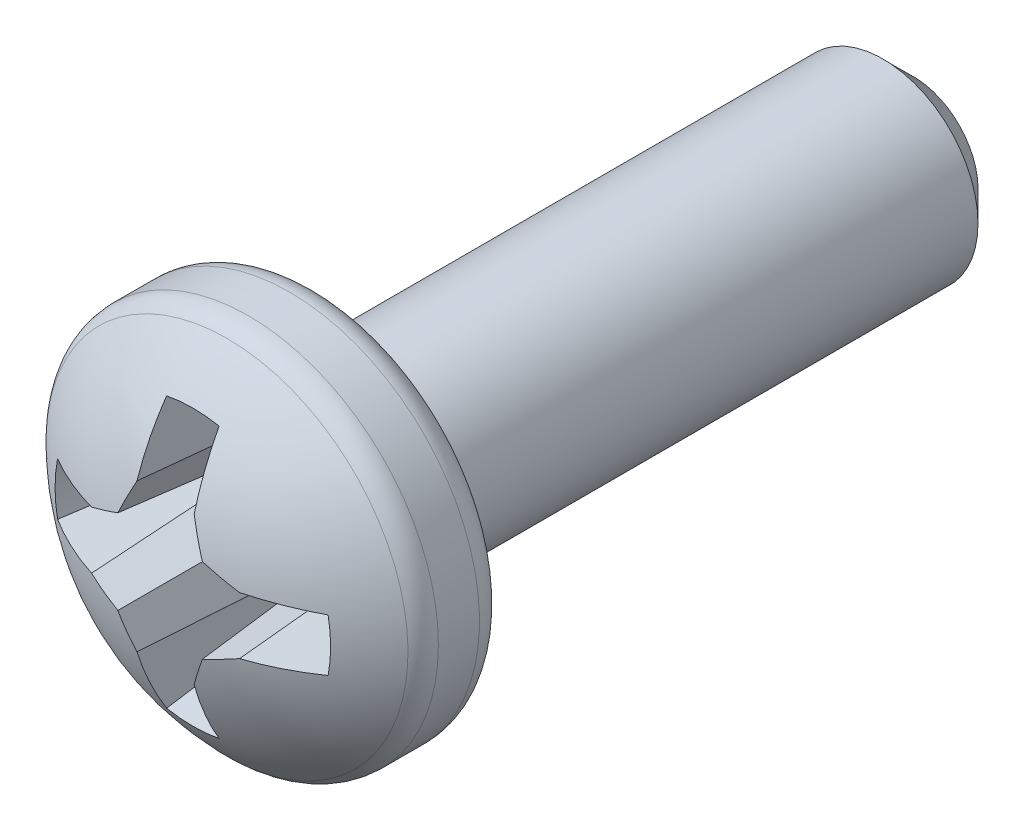
ISO-10303-21;
HEADER;
FILE_DESCRIPTION(('STEP AP214'),'2;1');
FILE_NAME('part.step','',(''),(''),'','','');
FILE_SCHEMA(('AUTOMOTIVE_DESIGN { 1 0 10303 214 1 1 1 1 }'));
ENDSEC;
DATA;
#1=APPLICATION_CONTEXT('core data for automotive mechanical design processes');
#2=APPLICATION_PROTOCOL_DEFINITION('international standard','automotive_design',2000,#1);
#3=PRODUCT_CONTEXT('',#1,'mechanical');
#4=PRODUCT('Part','Part','',(#3));
#5=PRODUCT_RELATED_PRODUCT_CATEGORY('part','',(#4));
#6=PRODUCT_DEFINITION_FORMATION('','',#4);
#7=PRODUCT_DEFINITION_CONTEXT('part definition',#1,'design');
#8=PRODUCT_DEFINITION('design','',#6,#7);
#9=PRODUCT_DEFINITION_SHAPE('','',#8);
#10=(LENGTH_UNIT() NAMED_UNIT(*) SI_UNIT(.MILLI.,.METRE.));
#11=(NAMED_UNIT(*) PLANE_ANGLE_UNIT() SI_UNIT($,.RADIAN.));
#12=(NAMED_UNIT(*) SI_UNIT($,.STERADIAN.) SOLID_ANGLE_UNIT());
#13=UNCERTAINTY_MEASURE_WITH_UNIT(LENGTH_MEASURE(1.E-05),#10,'distance_accuracy_value','');
#14=(GEOMETRIC_REPRESENTATION_CONTEXT(3) GLOBAL_UNCERTAINTY_ASSIGNED_CONTEXT((#13)) GLOBAL_UNIT_ASSIGNED_CONTEXT((#10,
#11,#12)) REPRESENTATION_CONTEXT('',''));
#15=CARTESIAN_POINT('',(0.,0.,0.));
#16=DIRECTION('',(0.,0.,1.));
#17=DIRECTION('',(1.,0.,0.));
#18=AXIS2_PLACEMENT_3D('',#15,#16,#17);
#19=CARTESIAN_POINT('',(-0.181321674615797,0.791461441644268,0.413196607862429));
#20=DIRECTION('',(0.,0.,1.));
#21=DIRECTION('',(1.,0.,0.));
#22=AXIS2_PLACEMENT_3D('',#19,#20,#21);
#23=PLANE('',#22);
#24=DIRECTION('',(0.382683432365081,-0.92387953251129,0.));
#25=VECTOR('',#24,1.);
#26=CARTESIAN_POINT('',(-0.168007787845929,0.796976234112247,0.413196607862429));
#27=LINE('',#26,#25);
#28=CARTESIAN_POINT('',(-0.175578033261302,0.815252423264536,0.413196607862429));
#29=VERTEX_POINT('',#28);
#30=CARTESIAN_POINT('',(-0.170292089679838,0.802491026580226,0.413196607862429));
#31=VERTEX_POINT('',#30);
#32=EDGE_CURVE('E292',#29,#31,#27,.T.);
#33=ORIENTED_EDGE('',*,*,#32,.F.);
#34=DIRECTION('',(0.,1.,0.));
#35=VECTOR('',#34,1.);
#36=CARTESIAN_POINT('',(-0.175578033261302,0.791461441644268,0.413196607862429));
#37=LINE('',#36,#35);
#38=CARTESIAN_POINT('',(-0.175578033261302,0.827667770296582,0.413196607862429));
#39=VERTEX_POINT('',#38);
#40=EDGE_CURVE('E168',#39,#29,#37,.F.);
#41=ORIENTED_EDGE('',*,*,#40,.F.);
#42=CARTESIAN_POINT('',(-0.181321674615797,0.791461441644268,0.413196607862429));
#43=DIRECTION('',(0.,0.,1.));
#44=DIRECTION('',(1.,0.,0.));
#45=AXIS2_PLACEMENT_3D('',#42,#43,#44);
#46=CIRCLE('',#45,0.0366590732355365);
#47=CARTESIAN_POINT('',(-0.187065315970288,0.827667770296583,0.413196607862429));
#48=VERTEX_POINT('',#47);
#49=EDGE_CURVE('E159',#39,#48,#46,.T.);
#50=ORIENTED_EDGE('',*,*,#49,.T.);
#51=DIRECTION('',(0.,1.,0.));
#52=VECTOR('',#51,1.);
#53=CARTESIAN_POINT('',(-0.187065315970287,0.791461441644271,0.413196607862429));
#54=LINE('',#53,#52);
#55=CARTESIAN_POINT('',(-0.187065315970288,0.815252423264539,0.413196607862429));
#56=VERTEX_POINT('',#55);
#57=EDGE_CURVE('E166',#56,#48,#54,.T.);
#58=ORIENTED_EDGE('',*,*,#57,.F.);
#59=DIRECTION('',(0.382683432365079,0.923879532511291,0.));
#60=VECTOR('',#59,1.);
#61=CARTESIAN_POINT('',(-0.194635561385662,0.79697623411225,0.413196607862429));
#62=LINE('',#61,#60);
#63=CARTESIAN_POINT('',(-0.192351259551752,0.802491026580229,0.413196607862429));
#64=VERTEX_POINT('',#63);
#65=EDGE_CURVE('E301',#64,#56,#62,.T.);
#66=ORIENTED_EDGE('',*,*,#65,.F.);
#67=DIRECTION('',(0.923879532511289,0.382683432365086,0.));
#68=VECTOR('',#67,1.);
#69=CARTESIAN_POINT('',(-0.186836467083772,0.804775328414139,0.413196607862429));
#70=LINE('',#69,#68);
#71=CARTESIAN_POINT('',(-0.205112656236062,0.797205082998765,0.413196607862429));
#72=VERTEX_POINT('',#71);
#73=EDGE_CURVE('E307',#72,#64,#70,.T.);
#74=ORIENTED_EDGE('',*,*,#73,.F.);
#75=DIRECTION('',(1.,0.,0.));
#76=VECTOR('',#75,1.);
#77=CARTESIAN_POINT('',(-0.181321674615793,0.797205082998765,0.413196607862429));
#78=LINE('',#77,#76);
#79=CARTESIAN_POINT('',(-0.217528003323473,0.797205082997996,0.413196607853642));
#80=VERTEX_POINT('',#79);
#81=EDGE_CURVE('E313',#80,#72,#78,.T.);
#82=ORIENTED_EDGE('',*,*,#81,.F.);
#83=CARTESIAN_POINT('',(-0.181321674615794,0.791461441644271,0.413196607862429));
#84=DIRECTION('',(0.,0.,1.));
#85=DIRECTION('',(1.,0.,0.));
#86=AXIS2_PLACEMENT_3D('',#83,#84,#85);
#87=CIRCLE('',#86,0.0366590732924525);
#88=CARTESIAN_POINT('',(-0.217528003325736,0.78571780028978,0.413196607862429));
#89=VERTEX_POINT('',#88);
#90=EDGE_CURVE('E410',#80,#89,#87,.T.);
#91=ORIENTED_EDGE('',*,*,#90,.T.);
#92=DIRECTION('',(1.,0.,0.));
#93=VECTOR('',#92,1.);
#94=CARTESIAN_POINT('',(-0.181321674615797,0.78571780028978,0.413196607862429));
#95=LINE('',#94,#93);
#96=CARTESIAN_POINT('',(-0.205112656236065,0.78571780028978,0.413196607862429));
#97=VERTEX_POINT('',#96);
#98=EDGE_CURVE('E247',#97,#89,#95,.F.);
#99=ORIENTED_EDGE('',*,*,#98,.F.);
#100=DIRECTION('',(-0.923879532511292,0.382683432365076,0.));
#101=VECTOR('',#100,1.);
#102=CARTESIAN_POINT('',(-0.186836467083776,0.778147554874406,0.413196607862429));
#103=LINE('',#102,#101);
#104=CARTESIAN_POINT('',(-0.192351259551755,0.780431856708316,0.413196607862429));
#105=VERTEX_POINT('',#104);
#106=EDGE_CURVE('E248',#105,#97,#103,.T.);
#107=ORIENTED_EDGE('',*,*,#106,.F.);
#108=DIRECTION('',(-0.38268343236509,0.923879532511287,0.));
#109=VECTOR('',#108,1.);
#110=CARTESIAN_POINT('',(-0.194635561385665,0.785946649176296,0.413196607862429));
#111=LINE('',#110,#109);
#112=CARTESIAN_POINT('',(-0.18706531597029,0.767670460024005,0.413196607862429));
#113=VERTEX_POINT('',#112);
#114=EDGE_CURVE('E254',#113,#105,#111,.T.);
#115=ORIENTED_EDGE('',*,*,#114,.F.);
#116=DIRECTION('',(0.,1.,0.));
#117=VECTOR('',#116,1.);
#118=CARTESIAN_POINT('',(-0.187065315970291,0.791461441644275,0.413196607862429));
#119=LINE('',#118,#117);
#120=CARTESIAN_POINT('',(-0.18706531597029,0.755255112961119,0.413196607862429));
#121=VERTEX_POINT('',#120);
#122=EDGE_CURVE('E260',#121,#113,#119,.T.);
#123=ORIENTED_EDGE('',*,*,#122,.F.);
#124=CARTESIAN_POINT('',(-0.181321674615796,0.791461441644275,0.413196607862429));
#125=DIRECTION('',(0.,0.,1.));
#126=DIRECTION('',(1.,0.,0.));
#127=AXIS2_PLACEMENT_3D('',#124,#125,#126);
#128=CIRCLE('',#127,0.0366590732659973);
#129=CARTESIAN_POINT('',(-0.175578033261305,0.755255112961118,0.413196607862429));
#130=VERTEX_POINT('',#129);
#131=EDGE_CURVE('E336',#121,#130,#128,.T.);
#132=ORIENTED_EDGE('',*,*,#131,.T.);
#133=DIRECTION('',(0.,1.,0.));
#134=VECTOR('',#133,1.);
#135=CARTESIAN_POINT('',(-0.175578033261306,0.791461441644272,0.413196607862429));
#136=LINE('',#135,#134);
#137=CARTESIAN_POINT('',(-0.175578033261305,0.767670460024002,0.413196607862429));
#138=VERTEX_POINT('',#137);
#139=EDGE_CURVE('E266',#138,#130,#136,.F.);
#140=ORIENTED_EDGE('',*,*,#139,.F.);
#141=DIRECTION('',(-0.382683432365075,-0.923879532511293,0.));
#142=VECTOR('',#141,1.);
#143=CARTESIAN_POINT('',(-0.168007787845931,0.785946649176293,0.413196607862429));
#144=LINE('',#143,#142);
#145=CARTESIAN_POINT('',(-0.170292089679841,0.780431856708313,0.413196607862429));
#146=VERTEX_POINT('',#145);
#147=EDGE_CURVE('E267',#146,#138,#144,.T.);
#148=ORIENTED_EDGE('',*,*,#147,.F.);
#149=DIRECTION('',(-0.923879532511286,-0.382683432365092,0.));
#150=VECTOR('',#149,1.);
#151=CARTESIAN_POINT('',(-0.175806882147821,0.778147554874402,0.413196607862429));
#152=LINE('',#151,#150);
#153=CARTESIAN_POINT('',(-0.157530692995531,0.785717800289777,0.413196607862429));
#154=VERTEX_POINT('',#153);
#155=EDGE_CURVE('E273',#154,#146,#152,.T.);
#156=ORIENTED_EDGE('',*,*,#155,.F.);
#157=DIRECTION('',(1.,0.,0.));
#158=VECTOR('',#157,1.);
#159=CARTESIAN_POINT('',(-0.1813216746158,0.785717800289777,0.413196607862429));
#160=LINE('',#159,#158);
#161=CARTESIAN_POINT('',(-0.145115345963483,0.785717800289777,0.413196607862429));
#162=VERTEX_POINT('',#161);
#163=EDGE_CURVE('E279',#162,#154,#160,.F.);
#164=ORIENTED_EDGE('',*,*,#163,.F.);
#165=CARTESIAN_POINT('',(-0.181321674615797,0.791461441644268,0.413196607862429));
#166=DIRECTION('',(0.,0.,1.));
#167=DIRECTION('',(1.,0.,0.));
#168=AXIS2_PLACEMENT_3D('',#165,#166,#167);
#169=CIRCLE('',#168,0.0366590732355365);
#170=CARTESIAN_POINT('',(-0.145115345963483,0.797205082998762,0.413196607862429));
#171=VERTEX_POINT('',#170);
#172=EDGE_CURVE('E492',#162,#171,#169,.T.);
#173=ORIENTED_EDGE('',*,*,#172,.T.);
#174=DIRECTION('',(1.,0.,0.));
#175=VECTOR('',#174,1.);
#176=CARTESIAN_POINT('',(-0.181321674615797,0.797205082998762,0.413196607862429));
#177=LINE('',#176,#175);
#178=CARTESIAN_POINT('',(-0.157530692995528,0.797205082998762,0.413196607862429));
#179=VERTEX_POINT('',#178);
#180=EDGE_CURVE('E285',#179,#171,#177,.T.);
#181=ORIENTED_EDGE('',*,*,#180,.F.);
#182=DIRECTION('',(0.92387953251129,-0.382683432365083,0.));
#183=VECTOR('',#182,1.);
#184=CARTESIAN_POINT('',(-0.175806882147818,0.804775328414136,0.413196607862429));
#185=LINE('',#184,#183);
#186=EDGE_CURVE('E286',#31,#179,#185,.T.);
#187=ORIENTED_EDGE('',*,*,#186,.F.);
#188=EDGE_LOOP('',(#33,#41,#50,#58,#66,#74,#82,#91,#99,#107,#115,#123,#132,#140,#148,#156,#164,
#173,#181,#187));
#189=FACE_BOUND('',#188,.T.);
#190=ADVANCED_FACE('F17',(#189),#23,.T.);
#191=CARTESIAN_POINT('',(-0.181321674615793,0.801303961329311,0.460047001563216));
#192=DIRECTION('',(0.,-0.996194698091744,0.0871557427476727));
#193=DIRECTION('',(0.,-0.0871557427476727,-0.996194698091744));
#194=AXIS2_PLACEMENT_3D('',#191,#192,#193);
#195=PLANE('',#194);
#196=DIRECTION('',(0.0173337504938655,-0.0871426484044457,-0.996045029063885));
#197=VECTOR('',#196,1.);
#198=CARTESIAN_POINT('',(-0.205856056740422,0.8009424097128,0.455914447676356));
#199=LINE('',#198,#197);
#200=CARTESIAN_POINT('',(-0.205856056740422,0.8009424097128,0.455914447676356));
#201=VERTEX_POINT('',#200);
#202=EDGE_CURVE('E310',#201,#72,#199,.T.);
#203=ORIENTED_EDGE('',*,*,#202,.F.);
#204=CARTESIAN_POINT('',(-0.2261693076876,0.80015108887588,0.446869609122098));
#205=CARTESIAN_POINT('',(-0.222980948004435,0.800321424804083,0.448816557690383));
#206=CARTESIAN_POINT('',(-0.219693997250593,0.800472536171256,0.450543768520713));
#207=CARTESIAN_POINT('',(-0.212922913601555,0.800736309783543,0.453558714705461));
#208=CARTESIAN_POINT('',(-0.209438780706359,0.800848972028658,0.45484645005988));
#209=CARTESIAN_POINT('',(-0.205856056740486,0.800942409712743,0.455914447676343));
#210=B_SPLINE_CURVE_WITH_KNOTS('',3,(#204,#205,#206,#207,#208,#209),.UNSPECIFIED.,.F.,.F.,(4,2,
4),(0.,0.0111485978671279,0.0222971957342558),.UNSPECIFIED.);
#211=CARTESIAN_POINT('',(-0.226169307677023,0.800151088874494,0.446869609106245));
#212=VERTEX_POINT('',#211);
#213=EDGE_CURVE('E409',#212,#201,#210,.T.);
#214=ORIENTED_EDGE('',*,*,#213,.F.);
#215=CARTESIAN_POINT('',(-0.226169307666445,0.800151088873107,0.446869609090391));
#216=CARTESIAN_POINT('',(-0.224732839888683,0.79966000435443,0.441256487356838));
#217=CARTESIAN_POINT('',(-0.223294497313129,0.799168961608414,0.435643843086986));
#218=CARTESIAN_POINT('',(-0.220414062531476,0.798186959649785,0.424419509338453));
#219=CARTESIAN_POINT('',(-0.218971970325285,0.797696000437175,0.418807819859794));
#220=CARTESIAN_POINT('',(-0.217528003321212,0.797205082997228,0.413196607844861));
#221=B_SPLINE_CURVE_WITH_KNOTS('',3,(#215,#216,#217,#218,#219,#220),.UNSPECIFIED.,.F.,.F.,(4,2,
4),(0.,0.0174443558891328,0.0348887122017161),.UNSPECIFIED.);
#222=EDGE_CURVE('E318',#212,#80,#221,.T.);
#223=ORIENTED_EDGE('',*,*,#222,.T.);
#224=ORIENTED_EDGE('',*,*,#81,.T.);
#225=EDGE_LOOP('',(#203,#214,#223,#224));
#226=FACE_BOUND('',#225,.T.);
#227=ADVANCED_FACE('F427',(#226),#195,.T.);
#228=CARTESIAN_POINT('',(-0.188405039912152,0.808562198209984,0.460047001563216));
#229=DIRECTION('',(0.381227206369649,-0.920363891963225,0.0871557427476661));
#230=DIRECTION('',(0.923879532511289,0.382683432365086,0.));
#231=AXIS2_PLACEMENT_3D('',#228,#229,#230);
#232=PLANE('',#231);
#233=DIRECTION('',(0.066662691346821,-0.0666626913468416,-0.995546167269401));
#234=VECTOR('',#233,1.);
#235=CARTESIAN_POINT('',(-0.195333038303313,0.805472805331791,0.457726739301586));
#236=LINE('',#235,#234);
#237=CARTESIAN_POINT('',(-0.195333038303313,0.805472805331791,0.457726739301586));
#238=VERTEX_POINT('',#237);
#239=EDGE_CURVE('E304',#238,#64,#236,.T.);
#240=ORIENTED_EDGE('',*,*,#239,.F.);
#241=CARTESIAN_POINT('',(-0.205856056740422,0.8009424097128,0.455914447676356));
#242=CARTESIAN_POINT('',(-0.204125687185487,0.801700049456702,0.456346321822599));
#243=CARTESIAN_POINT('',(-0.202383584204927,0.802456402296903,0.456713283197823));
#244=CARTESIAN_POINT('',(-0.198875911392557,0.8039665341699,0.457317380406233));
#245=CARTESIAN_POINT('',(-0.197110341560748,0.804720313202696,0.457554516239419));
#246=CARTESIAN_POINT('',(-0.195333038303313,0.805472805331791,0.457726739301586));
#247=B_SPLINE_CURVE_WITH_KNOTS('',3,(#241,#242,#243,#244,#245,#246),.UNSPECIFIED.,.F.,.F.,(4,2,
4),(0.,0.00580300590917773,0.0116060118183554),.UNSPECIFIED.);
#248=EDGE_CURVE('E439',#201,#238,#247,.T.);
#249=ORIENTED_EDGE('',*,*,#248,.F.);
#250=ORIENTED_EDGE('',*,*,#202,.T.);
#251=ORIENTED_EDGE('',*,*,#73,.T.);
#252=EDGE_LOOP('',(#240,#249,#250,#251));
#253=FACE_BOUND('',#252,.T.);
#254=ADVANCED_FACE('F431',(#253),#232,.T.);
#255=CARTESIAN_POINT('',(-0.198422431181506,0.79854480694063,0.460047001563216));
#256=DIRECTION('',(0.920363891963229,-0.381227206369643,0.0871557427476506));
#257=DIRECTION('',(0.382683432365079,0.923879532511291,0.));
#258=AXIS2_PLACEMENT_3D('',#255,#256,#257);
#259=PLANE('',#258);
#260=DIRECTION('',(0.0871426484044251,-0.0173337504938855,-0.996045029063886));
#261=VECTOR('',#260,1.);
#262=CARTESIAN_POINT('',(-0.190802642684322,0.8159958237689,0.455914447676355));
#263=LINE('',#262,#261);
#264=CARTESIAN_POINT('',(-0.190802642684322,0.8159958237689,0.455914447676355));
#265=VERTEX_POINT('',#264);
#266=EDGE_CURVE('E176',#265,#56,#263,.T.);
#267=ORIENTED_EDGE('',*,*,#266,.F.);
#268=CARTESIAN_POINT('',(-0.195333038303313,0.805472805331791,0.457726739301586));
#269=CARTESIAN_POINT('',(-0.194580546174218,0.807250108589226,0.457554516239419));
#270=CARTESIAN_POINT('',(-0.193826767141422,0.809015678421036,0.457317380406232));
#271=CARTESIAN_POINT('',(-0.192316635268425,0.812523351233405,0.456713283197822));
#272=CARTESIAN_POINT('',(-0.191560282428224,0.814265454213965,0.456346321822598));
#273=CARTESIAN_POINT('',(-0.190802642684322,0.8159958237689,0.455914447676355));
#274=B_SPLINE_CURVE_WITH_KNOTS('',3,(#268,#269,#270,#271,#272,#273),.UNSPECIFIED.,.F.,.F.,(4,2,
4),(0.,0.00580300590917794,0.0116060118183557),.UNSPECIFIED.);
#275=EDGE_CURVE('E445',#238,#265,#274,.T.);
#276=ORIENTED_EDGE('',*,*,#275,.F.);
#277=ORIENTED_EDGE('',*,*,#239,.T.);
#278=ORIENTED_EDGE('',*,*,#65,.T.);
#279=EDGE_LOOP('',(#267,#276,#277,#278));
#280=FACE_BOUND('',#279,.T.);
#281=ADVANCED_FACE('F436',(#280),#259,.T.);
#282=CARTESIAN_POINT('',(-0.191164194300832,0.791461441644271,0.460047001563216));
#283=DIRECTION('',(0.996194698091747,0.,0.0871557427476441));
#284=DIRECTION('',(0.0871557427476441,0.,-0.996194698091747));
#285=AXIS2_PLACEMENT_3D('',#282,#283,#284);
#286=PLANE('',#285);
#287=CARTESIAN_POINT('',(-0.187065315976045,0.827667770305358,0.413196607882864));
#288=CARTESIAN_POINT('',(-0.187556233413911,0.829111737314682,0.418807819896698));
#289=CARTESIAN_POINT('',(-0.188047192625085,0.830553829526685,0.424419509374058));
#290=CARTESIAN_POINT('',(-0.189029194582127,0.833434264321087,0.435643843119598));
#291=CARTESIAN_POINT('',(-0.189520237327995,0.834872606903579,0.441256487387755));
#292=CARTESIAN_POINT('',(-0.190011321847168,0.83630907468884,0.446869609119416));
#293=B_SPLINE_CURVE_WITH_KNOTS('',3,(#287,#288,#289,#290,#291,#292),.UNSPECIFIED.,.F.,.F.,(4,2,
4),(0.,0.0174443563127849,0.0348887122021206),.UNSPECIFIED.);
#294=CARTESIAN_POINT('',(-0.19001132184661,0.836309074687208,0.446869609113043));
#295=VERTEX_POINT('',#294);
#296=EDGE_CURVE('E170',#48,#295,#293,.T.);
#297=ORIENTED_EDGE('',*,*,#296,.T.);
#298=CARTESIAN_POINT('',(-0.190802642684322,0.8159958237689,0.455914447676355));
#299=CARTESIAN_POINT('',(-0.190709205000274,0.819578547732283,0.454846450060644));
#300=CARTESIAN_POINT('',(-0.190596542755232,0.823062680625144,0.45355871470727));
#301=CARTESIAN_POINT('',(-0.190332769143161,0.829833764269824,0.450543768525194));
#302=CARTESIAN_POINT('',(-0.190181657776132,0.833120715021642,0.448816557696492));
#303=CARTESIAN_POINT('',(-0.19001132184811,0.836309074702938,0.446869609130127));
#304=B_SPLINE_CURVE_WITH_KNOTS('',3,(#298,#299,#300,#301,#302,#303),.UNSPECIFIED.,.F.,.F.,(4,2,
4),(0.,0.0111485978594692,0.0222971957189382),.UNSPECIFIED.);
#305=EDGE_CURVE('E450',#265,#295,#304,.T.);
#306=ORIENTED_EDGE('',*,*,#305,.F.);
#307=ORIENTED_EDGE('',*,*,#266,.T.);
#308=ORIENTED_EDGE('',*,*,#57,.T.);
#309=EDGE_LOOP('',(#297,#306,#307,#308));
#310=FACE_BOUND('',#309,.T.);
#311=ADVANCED_FACE('F173',(#310),#286,.T.);
#312=CARTESIAN_POINT('',(-0.181321674615797,0.791461441644268,0.44686960910667));
#313=DIRECTION('',(0.,0.,1.));
#314=DIRECTION('',(0.,-1.,0.));
#315=AXIS2_PLACEMENT_3D('',#312,#313,#314);
#316=CONICAL_SURFACE('',#315,0.0456817267448834,0.261799388331704);
#317=ORIENTED_EDGE('',*,*,#296,.F.);
#318=ORIENTED_EDGE('',*,*,#49,.F.);
#319=CARTESIAN_POINT('',(-0.172632027379857,0.836309074694092,0.446869609126833));
#320=CARTESIAN_POINT('',(-0.17312311190055,0.834872606907088,0.441256487392621));
#321=CARTESIAN_POINT('',(-0.173614154647945,0.833434264322827,0.435643843121919));
#322=CARTESIAN_POINT('',(-0.17459615660806,0.830553829524832,0.424419509371304));
#323=CARTESIAN_POINT('',(-0.175087115820778,0.829111737311007,0.418807819891415));
#324=CARTESIAN_POINT('',(-0.175578033260197,0.827667770299833,0.41319660787506));
#325=B_SPLINE_CURVE_WITH_KNOTS('',3,(#319,#320,#321,#322,#323,#324),.UNSPECIFIED.,.F.,.F.,(4,2,
4),(0.,0.0174443558984041,0.0348887122202595),.UNSPECIFIED.);
#326=CARTESIAN_POINT('',(-0.172632027383567,0.836309074696746,0.446869609129184));
#327=VERTEX_POINT('',#326);
#328=EDGE_CURVE('E182',#327,#39,#325,.T.);
#329=ORIENTED_EDGE('',*,*,#328,.F.);
#330=CARTESIAN_POINT('',(-0.181321674615797,0.791461441644268,0.44686960910667));
#331=DIRECTION('',(0.,0.,1.));
#332=DIRECTION('',(0.,-1.,0.));
#333=AXIS2_PLACEMENT_3D('',#330,#331,#332);
#334=CIRCLE('',#333,0.0456817267448834);
#335=EDGE_CURVE('E180',#295,#327,#334,.F.);
#336=ORIENTED_EDGE('',*,*,#335,.F.);
#337=EDGE_LOOP('',(#317,#318,#329,#336));
#338=FACE_BOUND('',#337,.T.);
#339=ADVANCED_FACE('F178',(#338),#316,.F.);
#340=CARTESIAN_POINT('',(-0.171479154930757,0.791461441644268,0.460047001563216));
#341=DIRECTION('',(-0.996194698091746,0.,0.0871557427476584));
#342=DIRECTION('',(0.0871557427476584,0.,0.996194698091746));
#343=AXIS2_PLACEMENT_3D('',#340,#341,#342);
#344=PLANE('',#343);
#345=DIRECTION('',(-0.0871426484044393,-0.0173337504938623,-0.996045029063886));
#346=VECTOR('',#345,1.);
#347=CARTESIAN_POINT('',(-0.171840706547268,0.815995823768896,0.455914447676356));
#348=LINE('',#347,#346);
#349=CARTESIAN_POINT('',(-0.171840706547268,0.815995823768896,0.455914447676356));
#350=VERTEX_POINT('',#349);
#351=EDGE_CURVE('E295',#350,#29,#348,.T.);
#352=ORIENTED_EDGE('',*,*,#351,.F.);
#353=CARTESIAN_POINT('',(-0.172632027383459,0.836309074702469,0.446869609130415));
#354=CARTESIAN_POINT('',(-0.172461691455441,0.833120715021241,0.44881655769671));
#355=CARTESIAN_POINT('',(-0.172310580088416,0.829833764269497,0.450543768525352));
#356=CARTESIAN_POINT('',(-0.17204680647635,0.823062680624978,0.45355871470733));
#357=CARTESIAN_POINT('',(-0.17193414423131,0.819578547732202,0.454846450060667));
#358=CARTESIAN_POINT('',(-0.171840706547262,0.81599582376891,0.45591444767635));
#359=B_SPLINE_CURVE_WITH_KNOTS('',3,(#353,#354,#355,#356,#357,#358),.UNSPECIFIED.,.F.,.F.,(4,2,
4),(0.,0.0111485978591886,0.0222971957183774),.UNSPECIFIED.);
#360=EDGE_CURVE('E210',#327,#350,#359,.T.);
#361=ORIENTED_EDGE('',*,*,#360,.F.);
#362=ORIENTED_EDGE('',*,*,#328,.T.);
#363=ORIENTED_EDGE('',*,*,#40,.T.);
#364=EDGE_LOOP('',(#352,#361,#362,#363));
#365=FACE_BOUND('',#364,.T.);
#366=ADVANCED_FACE('F199',(#365),#344,.T.);
#367=CARTESIAN_POINT('',(-0.164220918050084,0.798544806940627,0.460047001563216));
#368=DIRECTION('',(-0.920363891963228,-0.381227206369645,0.0871557427476584));
#369=DIRECTION('',(0.382683432365081,-0.92387953251129,0.));
#370=AXIS2_PLACEMENT_3D('',#367,#368,#369);
#371=PLANE('',#370);
#372=DIRECTION('',(-0.0666626913468198,-0.0666626913468392,-0.995546167269401));
#373=VECTOR('',#372,1.);
#374=CARTESIAN_POINT('',(-0.167310310928277,0.805472805331788,0.457726739301586));
#375=LINE('',#374,#373);
#376=CARTESIAN_POINT('',(-0.167310310928277,0.805472805331788,0.457726739301586));
#377=VERTEX_POINT('',#376);
#378=EDGE_CURVE('E289',#377,#31,#375,.T.);
#379=ORIENTED_EDGE('',*,*,#378,.F.);
#380=CARTESIAN_POINT('',(-0.171840706547268,0.815995823768896,0.455914447676356));
#381=CARTESIAN_POINT('',(-0.171083066803365,0.814265454213961,0.456346321822598));
#382=CARTESIAN_POINT('',(-0.170326713963165,0.812523351233401,0.456713283197823));
#383=CARTESIAN_POINT('',(-0.168816582090168,0.809015678421032,0.457317380406233));
#384=CARTESIAN_POINT('',(-0.168062803057372,0.807250108589223,0.457554516239419));
#385=CARTESIAN_POINT('',(-0.167310310928277,0.805472805331788,0.457726739301586));
#386=B_SPLINE_CURVE_WITH_KNOTS('',3,(#380,#381,#382,#383,#384,#385),.UNSPECIFIED.,.F.,.F.,(4,2,
4),(0.,0.00580300590917686,0.0116060118183539),.UNSPECIFIED.);
#387=EDGE_CURVE('E218',#350,#377,#386,.T.);
#388=ORIENTED_EDGE('',*,*,#387,.F.);
#389=ORIENTED_EDGE('',*,*,#351,.T.);
#390=ORIENTED_EDGE('',*,*,#32,.T.);
#391=EDGE_LOOP('',(#379,#388,#389,#390));
#392=FACE_BOUND('',#391,.T.);
#393=ADVANCED_FACE('F204',(#392),#371,.T.);
#394=CARTESIAN_POINT('',(-0.174238309319438,0.808562198209981,0.460047001563216));
#395=DIRECTION('',(-0.381227206369647,-0.920363891963227,0.0871557427476583));
#396=DIRECTION('',(0.92387953251129,-0.382683432365083,0.));
#397=AXIS2_PLACEMENT_3D('',#394,#395,#396);
#398=PLANE('',#397);
#399=DIRECTION('',(-0.0173337504938617,-0.0871426484044405,-0.996045029063885));
#400=VECTOR('',#399,1.);
#401=CARTESIAN_POINT('',(-0.156787292491168,0.800942409712797,0.455914447676356));
#402=LINE('',#401,#400);
#403=CARTESIAN_POINT('',(-0.156787292491168,0.800942409712797,0.455914447676356));
#404=VERTEX_POINT('',#403);
#405=EDGE_CURVE('E282',#404,#179,#402,.T.);
#406=ORIENTED_EDGE('',*,*,#405,.F.);
#407=CARTESIAN_POINT('',(-0.167310310928277,0.805472805331788,0.457726739301586));
#408=CARTESIAN_POINT('',(-0.165533007670842,0.804720313202693,0.457554516239419));
#409=CARTESIAN_POINT('',(-0.163767437839033,0.803966534169897,0.457317380406233));
#410=CARTESIAN_POINT('',(-0.160259765026663,0.8024564022969,0.456713283197822));
#411=CARTESIAN_POINT('',(-0.158517662046103,0.801700049456699,0.456346321822598));
#412=CARTESIAN_POINT('',(-0.156787292491168,0.800942409712797,0.455914447676355));
#413=B_SPLINE_CURVE_WITH_KNOTS('',3,(#407,#408,#409,#410,#411,#412),.UNSPECIFIED.,.F.,.F.,(4,2,
4),(0.,0.00580300590917777,0.0116060118183554),.UNSPECIFIED.);
#414=EDGE_CURVE('E462',#377,#404,#413,.T.);
#415=ORIENTED_EDGE('',*,*,#414,.F.);
#416=ORIENTED_EDGE('',*,*,#378,.T.);
#417=ORIENTED_EDGE('',*,*,#186,.T.);
#418=EDGE_LOOP('',(#406,#415,#416,#417));
#419=FACE_BOUND('',#418,.T.);
#420=ADVANCED_FACE('F474',(#419),#398,.T.);
#421=CARTESIAN_POINT('',(-0.181321674615797,0.801303961329307,0.460047001563216));
#422=DIRECTION('',(0.,-0.996194698091746,0.0871557427476584));
#423=DIRECTION('',(0.,-0.0871557427476584,-0.996194698091746));
#424=AXIS2_PLACEMENT_3D('',#421,#422,#423);
#425=PLANE('',#424);
#426=CARTESIAN_POINT('',(-0.145115345958229,0.797205083000547,0.413196607882838));
#427=CARTESIAN_POINT('',(-0.143671378947246,0.797696000440365,0.418807819896288));
#428=CARTESIAN_POINT('',(-0.142229286734121,0.798186959652845,0.424419509373458));
#429=CARTESIAN_POINT('',(-0.139348851938544,0.799168961611212,0.435643843119007));
#430=CARTESIAN_POINT('',(-0.137910509356002,0.799660004357097,0.441256487387363));
#431=CARTESIAN_POINT('',(-0.136474041571226,0.800151088875642,0.446869609119416));
#432=B_SPLINE_CURVE_WITH_KNOTS('',3,(#426,#427,#428,#429,#430,#431),.UNSPECIFIED.,.F.,.F.,(4,2,
4),(0.,0.0174443563134024,0.0348887122033544),.UNSPECIFIED.);
#433=CARTESIAN_POINT('',(-0.136474041572858,0.800151088875085,0.446869609113043));
#434=VERTEX_POINT('',#433);
#435=EDGE_CURVE('E351',#171,#434,#432,.T.);
#436=ORIENTED_EDGE('',*,*,#435,.T.);
#437=CARTESIAN_POINT('',(-0.156787292491168,0.800942409712797,0.455914447676355));
#438=CARTESIAN_POINT('',(-0.153204568527773,0.800848972028767,0.454846450060639));
#439=CARTESIAN_POINT('',(-0.149720435634899,0.800736309783725,0.453558714707259));
#440=CARTESIAN_POINT('',(-0.142949351990196,0.800472536171615,0.450543768525174));
#441=CARTESIAN_POINT('',(-0.139662401238367,0.800321424804546,0.448816557696469));
#442=CARTESIAN_POINT('',(-0.13647404155706,0.800151088876465,0.4468696091301));
#443=B_SPLINE_CURVE_WITH_KNOTS('',3,(#437,#438,#439,#440,#441,#442),.UNSPECIFIED.,.F.,.F.,(4,2,
4),(0.,0.0111485978595087,0.0222971957190174),.UNSPECIFIED.);
#444=EDGE_CURVE('E463',#404,#434,#443,.T.);
#445=ORIENTED_EDGE('',*,*,#444,.F.);
#446=ORIENTED_EDGE('',*,*,#405,.T.);
#447=ORIENTED_EDGE('',*,*,#180,.T.);
#448=EDGE_LOOP('',(#436,#445,#446,#447));
#449=FACE_BOUND('',#448,.T.);
#450=ADVANCED_FACE('F477',(#449),#425,.T.);
#451=CARTESIAN_POINT('',(-0.181321674615797,0.791461441644268,0.44686960910667));
#452=DIRECTION('',(0.,0.,1.));
#453=DIRECTION('',(0.,-1.,0.));
#454=AXIS2_PLACEMENT_3D('',#451,#452,#453);
#455=CONICAL_SURFACE('',#454,0.0456817267448834,0.261799388331704);
#456=ORIENTED_EDGE('',*,*,#172,.F.);
#457=CARTESIAN_POINT('',(-0.136474041565972,0.782771794408332,0.446869609126833));
#458=CARTESIAN_POINT('',(-0.137910509353027,0.783262878929042,0.441256487392422));
#459=CARTESIAN_POINT('',(-0.139348851937339,0.783753921676455,0.435643843121522));
#460=CARTESIAN_POINT('',(-0.142229286735436,0.784735923636604,0.424419509370512));
#461=CARTESIAN_POINT('',(-0.143671378949313,0.78522688284934,0.418807819890424));
#462=CARTESIAN_POINT('',(-0.145115345960537,0.785717800288776,0.413196607873871));
#463=B_SPLINE_CURVE_WITH_KNOTS('',3,(#457,#458,#459,#460,#461,#462),.UNSPECIFIED.,.F.,.F.,(4,2,
4),(0.,0.0174443558990201,0.0348887122214916),.UNSPECIFIED.);
#464=CARTESIAN_POINT('',(-0.136474041563318,0.782771794412042,0.446869609129184));
#465=VERTEX_POINT('',#464);
#466=EDGE_CURVE('E346',#465,#162,#463,.T.);
#467=ORIENTED_EDGE('',*,*,#466,.F.);
#468=CARTESIAN_POINT('',(-0.181321674615797,0.791461441644268,0.44686960910667));
#469=DIRECTION('',(0.,0.,1.));
#470=DIRECTION('',(0.,-1.,0.));
#471=AXIS2_PLACEMENT_3D('',#468,#469,#470);
#472=CIRCLE('',#471,0.0456817267448834);
#473=EDGE_CURVE('E464',#434,#465,#472,.F.);
#474=ORIENTED_EDGE('',*,*,#473,.F.);
#475=ORIENTED_EDGE('',*,*,#435,.F.);
#476=EDGE_LOOP('',(#456,#467,#474,#475));
#477=FACE_BOUND('',#476,.T.);
#478=ADVANCED_FACE('F482',(#477),#455,.F.);
#479=CARTESIAN_POINT('',(-0.1813216746158,0.781618921959232,0.460047001563216));
#480=DIRECTION('',(0.,0.996194698091747,0.0871557427476441));
#481=DIRECTION('',(0.,-0.0871557427476441,0.996194698091747));
#482=AXIS2_PLACEMENT_3D('',#479,#480,#481);
#483=PLANE('',#482);
#484=DIRECTION('',(-0.0173337504938417,0.0871426484044261,-0.996045029063887));
#485=VECTOR('',#484,1.);
#486=CARTESIAN_POINT('',(-0.156787292491172,0.781980473575742,0.455914447676357));
#487=LINE('',#486,#485);
#488=CARTESIAN_POINT('',(-0.156787292491172,0.781980473575742,0.455914447676357));
#489=VERTEX_POINT('',#488);
#490=EDGE_CURVE('E276',#489,#154,#487,.T.);
#491=ORIENTED_EDGE('',*,*,#490,.F.);
#492=CARTESIAN_POINT('',(-0.136474041557595,0.782771794411935,0.446869609130414));
#493=CARTESIAN_POINT('',(-0.139662401238816,0.782601458483907,0.448816557696704));
#494=CARTESIAN_POINT('',(-0.142949351990553,0.782450347116882,0.450543768525343));
#495=CARTESIAN_POINT('',(-0.149720435635057,0.782186573504837,0.45355871470732));
#496=CARTESIAN_POINT('',(-0.153204568527825,0.782073911259817,0.454846450060657));
#497=CARTESIAN_POINT('',(-0.156787292491108,0.7819804735758,0.455914447676344));
#498=B_SPLINE_CURVE_WITH_KNOTS('',3,(#492,#493,#494,#495,#496,#497),.UNSPECIFIED.,.F.,.F.,(4,2,
4),(0.,0.0111485978591655,0.0222971957183309),.UNSPECIFIED.);
#499=EDGE_CURVE('E509',#465,#489,#498,.T.);
#500=ORIENTED_EDGE('',*,*,#499,.F.);
#501=ORIENTED_EDGE('',*,*,#466,.T.);
#502=ORIENTED_EDGE('',*,*,#163,.T.);
#503=EDGE_LOOP('',(#491,#500,#501,#502));
#504=FACE_BOUND('',#503,.T.);
#505=ADVANCED_FACE('F499',(#504),#483,.T.);
#506=CARTESIAN_POINT('',(-0.174238309319441,0.774360685078558,0.460047001563216));
#507=DIRECTION('',(-0.381227206369656,0.920363891963225,0.0871557427476397));
#508=DIRECTION('',(-0.923879532511286,-0.382683432365092,0.));
#509=AXIS2_PLACEMENT_3D('',#506,#507,#508);
#510=PLANE('',#509);
#511=DIRECTION('',(-0.0666626913468176,0.0666626913468194,-0.995546167269403));
#512=VECTOR('',#511,1.);
#513=CARTESIAN_POINT('',(-0.16731031092828,0.777450077956752,0.457726739301588));
#514=LINE('',#513,#512);
#515=CARTESIAN_POINT('',(-0.16731031092828,0.777450077956752,0.457726739301588));
#516=VERTEX_POINT('',#515);
#517=EDGE_CURVE('E270',#516,#146,#514,.T.);
#518=ORIENTED_EDGE('',*,*,#517,.F.);
#519=CARTESIAN_POINT('',(-0.156787292491172,0.781980473575742,0.455914447676357));
#520=CARTESIAN_POINT('',(-0.158517662046106,0.781222833831839,0.4563463218226));
#521=CARTESIAN_POINT('',(-0.160259765026666,0.780466480991639,0.456713283197824));
#522=CARTESIAN_POINT('',(-0.163767437839035,0.778956349118642,0.457317380406234));
#523=CARTESIAN_POINT('',(-0.165533007670845,0.778202570085846,0.45755451623942));
#524=CARTESIAN_POINT('',(-0.16731031092828,0.777450077956751,0.457726739301587));
#525=B_SPLINE_CURVE_WITH_KNOTS('',3,(#519,#520,#521,#522,#523,#524),.UNSPECIFIED.,.F.,.F.,(4,2,
4),(0.,0.00580300590917717,0.0116060118183544),.UNSPECIFIED.);
#526=EDGE_CURVE('E515',#489,#516,#525,.T.);
#527=ORIENTED_EDGE('',*,*,#526,.F.);
#528=ORIENTED_EDGE('',*,*,#490,.T.);
#529=ORIENTED_EDGE('',*,*,#155,.T.);
#530=EDGE_LOOP('',(#518,#527,#528,#529));
#531=FACE_BOUND('',#530,.T.);
#532=ADVANCED_FACE('F503',(#531),#510,.T.);
#533=CARTESIAN_POINT('',(-0.164220918050087,0.784378076347913,0.460047001563216));
#534=DIRECTION('',(-0.920363891963232,0.381227206369639,0.0871557427476397));
#535=DIRECTION('',(-0.382683432365075,-0.923879532511293,0.));
#536=AXIS2_PLACEMENT_3D('',#533,#534,#535);
#537=PLANE('',#536);
#538=DIRECTION('',(-0.0871426484044258,0.0173337504938366,-0.996045029063887));
#539=VECTOR('',#538,1.);
#540=CARTESIAN_POINT('',(-0.171840706547271,0.766927059519643,0.455914447676357));
#541=LINE('',#540,#539);
#542=CARTESIAN_POINT('',(-0.171840706547271,0.766927059519643,0.455914447676357));
#543=VERTEX_POINT('',#542);
#544=EDGE_CURVE('E263',#543,#138,#541,.T.);
#545=ORIENTED_EDGE('',*,*,#544,.F.);
#546=CARTESIAN_POINT('',(-0.16731031092828,0.777450077956752,0.457726739301587));
#547=CARTESIAN_POINT('',(-0.168062803057374,0.775672774699317,0.45755451623942));
#548=CARTESIAN_POINT('',(-0.168816582090171,0.773907204867507,0.457317380406234));
#549=CARTESIAN_POINT('',(-0.170326713963168,0.770399532055138,0.456713283197824));
#550=CARTESIAN_POINT('',(-0.171083066803368,0.768657429074578,0.4563463218226));
#551=CARTESIAN_POINT('',(-0.171840706547271,0.766927059519643,0.455914447676357));
#552=B_SPLINE_CURVE_WITH_KNOTS('',3,(#546,#547,#548,#549,#550,#551),.UNSPECIFIED.,.F.,.F.,(4,2,
4),(0.,0.0058030059091777,0.0116060118183554),.UNSPECIFIED.);
#553=EDGE_CURVE('E535',#516,#543,#552,.T.);
#554=ORIENTED_EDGE('',*,*,#553,.F.);
#555=ORIENTED_EDGE('',*,*,#517,.T.);
#556=ORIENTED_EDGE('',*,*,#147,.T.);
#557=EDGE_LOOP('',(#545,#554,#555,#556));
#558=FACE_BOUND('',#557,.T.);
#559=ADVANCED_FACE('F548',(#558),#537,.T.);
#560=CARTESIAN_POINT('',(-0.171479154930761,0.791461441644272,0.460047001563216));
#561=DIRECTION('',(-0.996194698091747,0.,0.0871557427476441));
#562=DIRECTION('',(0.0871557427476441,0.,0.996194698091747));
#563=AXIS2_PLACEMENT_3D('',#560,#561,#562);
#564=PLANE('',#563);
#565=CARTESIAN_POINT('',(-0.175578033259622,0.755255112956166,0.413196607881666));
#566=CARTESIAN_POINT('',(-0.175087115819843,0.75381114594526,0.418807819894682));
#567=CARTESIAN_POINT('',(-0.174596156607401,0.752369053732213,0.424419509371419));
#568=CARTESIAN_POINT('',(-0.17361415464911,0.749488618936795,0.435643843116102));
#569=CARTESIAN_POINT('',(-0.173123111903263,0.748050276354334,0.441256487384024));
#570=CARTESIAN_POINT('',(-0.172632027384755,0.746613808569641,0.446869609115645));
#571=B_SPLINE_CURVE_WITH_KNOTS('',3,(#565,#566,#567,#568,#569,#570),.UNSPECIFIED.,.F.,.F.,(4,2,
4),(0.,0.0174443563120792,0.034888712200708),.UNSPECIFIED.);
#572=CARTESIAN_POINT('',(-0.172632027385147,0.746613808570789,0.446869609111159));
#573=VERTEX_POINT('',#572);
#574=EDGE_CURVE('E559',#130,#573,#571,.T.);
#575=ORIENTED_EDGE('',*,*,#574,.T.);
#576=CARTESIAN_POINT('',(-0.171840706547271,0.766927059519643,0.455914447676357));
#577=CARTESIAN_POINT('',(-0.171934144231372,0.763344335554254,0.454846450060045));
#578=CARTESIAN_POINT('',(-0.172046806476487,0.759860202659512,0.453558714705833));
#579=CARTESIAN_POINT('',(-0.172310580088745,0.753089119011321,0.450543768521611));
#580=CARTESIAN_POINT('',(-0.172461691455888,0.749802168257872,0.448816557691601));
#581=CARTESIAN_POINT('',(-0.172632027384046,0.74661380857507,0.44686960912369));
#582=B_SPLINE_CURVE_WITH_KNOTS('',3,(#576,#577,#578,#579,#580,#581),.UNSPECIFIED.,.F.,.F.,(4,2,
4),(0.,0.011148597865636,0.0222971957312719),.UNSPECIFIED.);
#583=EDGE_CURVE('E536',#543,#573,#582,.T.);
#584=ORIENTED_EDGE('',*,*,#583,.F.);
#585=ORIENTED_EDGE('',*,*,#544,.T.);
#586=ORIENTED_EDGE('',*,*,#139,.T.);
#587=EDGE_LOOP('',(#575,#584,#585,#586));
#588=FACE_BOUND('',#587,.T.);
#589=ADVANCED_FACE('F551',(#588),#564,.T.);
#590=CARTESIAN_POINT('',(-0.181321674615796,0.791461441644275,0.446869608992983));
#591=DIRECTION('',(0.,0.,1.));
#592=DIRECTION('',(0.,-1.,0.));
#593=AXIS2_PLACEMENT_3D('',#590,#591,#592);
#594=CONICAL_SURFACE('',#593,0.0456817267448822,0.261799388331719);
#595=ORIENTED_EDGE('',*,*,#131,.F.);
#596=CARTESIAN_POINT('',(-0.190011321842566,0.746613808571931,0.446869609123233));
#597=CARTESIAN_POINT('',(-0.189520237326194,0.748050276355483,0.441256487387797));
#598=CARTESIAN_POINT('',(-0.18902919458168,0.749488618937451,0.435643843116295));
#599=CARTESIAN_POINT('',(-0.18804719262445,0.752369053733175,0.424419509364926));
#600=CARTESIAN_POINT('',(-0.187556233411736,0.753811145947023,0.418807819885083));
#601=CARTESIAN_POINT('',(-0.187065315970882,0.755255112959377,0.413196607869196));
#602=B_SPLINE_CURVE_WITH_KNOTS('',3,(#596,#597,#598,#599,#600,#601),.UNSPECIFIED.,.F.,.F.,(4,2,
4),(0.,0.0174443558982896,0.0348887122200282),.UNSPECIFIED.);
#603=CARTESIAN_POINT('',(-0.190011321847557,0.74661380857332,0.446869609123829));
#604=VERTEX_POINT('',#603);
#605=EDGE_CURVE('E331',#604,#121,#602,.T.);
#606=ORIENTED_EDGE('',*,*,#605,.F.);
#607=CARTESIAN_POINT('',(-0.181321674615796,0.791461441644275,0.44686960910667));
#608=DIRECTION('',(0.,0.,1.));
#609=DIRECTION('',(0.,-1.,0.));
#610=AXIS2_PLACEMENT_3D('',#607,#608,#609);
#611=CIRCLE('',#610,0.0456817267753445);
#612=EDGE_CURVE('E538',#573,#604,#611,.F.);
#613=ORIENTED_EDGE('',*,*,#612,.F.);
#614=ORIENTED_EDGE('',*,*,#574,.F.);
#615=EDGE_LOOP('',(#595,#606,#613,#614));
#616=FACE_BOUND('',#615,.T.);
#617=ADVANCED_FACE('F555',(#616),#594,.F.);
#618=CARTESIAN_POINT('',(-0.191164194300836,0.791461441644275,0.460047001563216));
#619=DIRECTION('',(0.996194698091746,0.,0.0871557427476584));
#620=DIRECTION('',(0.0871557427476584,0.,-0.996194698091746));
#621=AXIS2_PLACEMENT_3D('',#618,#619,#620);
#622=PLANE('',#621);
#623=DIRECTION('',(0.0871426484044407,0.0173337504938286,-0.996045029063886));
#624=VECTOR('',#623,1.);
#625=CARTESIAN_POINT('',(-0.190802642684325,0.766927059519646,0.455914447676358));
#626=LINE('',#625,#624);
#627=CARTESIAN_POINT('',(-0.190802642684325,0.766927059519647,0.455914447676358));
#628=VERTEX_POINT('',#627);
#629=EDGE_CURVE('E257',#628,#113,#626,.T.);
#630=ORIENTED_EDGE('',*,*,#629,.F.);
#631=CARTESIAN_POINT('',(-0.190011321847733,0.746613808578579,0.446869609125837));
#632=CARTESIAN_POINT('',(-0.190181657775847,0.749802168260878,0.448816557693231));
#633=CARTESIAN_POINT('',(-0.190332769142954,0.753089119013782,0.450543768522804));
#634=CARTESIAN_POINT('',(-0.190596542755153,0.7598602026608,0.453558714706309));
#635=CARTESIAN_POINT('',(-0.190709205000245,0.763344335554913,0.454846450060241));
#636=CARTESIAN_POINT('',(-0.190802642684331,0.766927059519632,0.455914447676352));
#637=B_SPLINE_CURVE_WITH_KNOTS('',3,(#631,#632,#633,#634,#635,#636),.UNSPECIFIED.,.F.,.F.,(4,2,
4),(0.,0.0111485978635756,0.0222971957271512),.UNSPECIFIED.);
#638=EDGE_CURVE('E574',#604,#628,#637,.T.);
#639=ORIENTED_EDGE('',*,*,#638,.F.);
#640=ORIENTED_EDGE('',*,*,#605,.T.);
#641=ORIENTED_EDGE('',*,*,#122,.T.);
#642=EDGE_LOOP('',(#630,#639,#640,#641));
#643=FACE_BOUND('',#642,.T.);
#644=ADVANCED_FACE('F582',(#643),#622,.T.);
#645=CARTESIAN_POINT('',(-0.198422431181509,0.784378076347916,0.460047001563216));
#646=DIRECTION('',(0.920363891963225,0.381227206369654,0.0871557427476474));
#647=DIRECTION('',(-0.38268343236509,0.923879532511287,0.));
#648=AXIS2_PLACEMENT_3D('',#645,#646,#647);
#649=PLANE('',#648);
#650=DIRECTION('',(0.0666626913468231,0.0666626913468074,-0.995546167269403));
#651=VECTOR('',#650,1.);
#652=CARTESIAN_POINT('',(-0.195333038303316,0.777450077956755,0.457726739301588));
#653=LINE('',#652,#651);
#654=CARTESIAN_POINT('',(-0.195333038303316,0.777450077956755,0.457726739301588));
#655=VERTEX_POINT('',#654);
#656=EDGE_CURVE('E251',#655,#105,#653,.T.);
#657=ORIENTED_EDGE('',*,*,#656,.F.);
#658=CARTESIAN_POINT('',(-0.190802642684325,0.766927059519647,0.455914447676357));
#659=CARTESIAN_POINT('',(-0.191560282428228,0.768657429074581,0.4563463218226));
#660=CARTESIAN_POINT('',(-0.192316635268428,0.770399532055141,0.456713283197824));
#661=CARTESIAN_POINT('',(-0.193826767141425,0.773907204867511,0.457317380406234));
#662=CARTESIAN_POINT('',(-0.194580546174222,0.77567277469932,0.45755451623942));
#663=CARTESIAN_POINT('',(-0.195333038303316,0.777450077956755,0.457726739301587));
#664=B_SPLINE_CURVE_WITH_KNOTS('',3,(#658,#659,#660,#661,#662,#663),.UNSPECIFIED.,.F.,.F.,(4,2,
4),(0.,0.0058030059091774,0.011606011818355),.UNSPECIFIED.);
#665=EDGE_CURVE('E575',#628,#655,#664,.T.);
#666=ORIENTED_EDGE('',*,*,#665,.F.);
#667=ORIENTED_EDGE('',*,*,#629,.T.);
#668=ORIENTED_EDGE('',*,*,#114,.T.);
#669=EDGE_LOOP('',(#657,#666,#667,#668));
#670=FACE_BOUND('',#669,.T.);
#671=ADVANCED_FACE('F585',(#670),#649,.T.);
#672=CARTESIAN_POINT('',(-0.188405039912155,0.774360685078562,0.460047001563217));
#673=DIRECTION('',(0.381227206369641,0.920363891963232,0.0871557427476319));
#674=DIRECTION('',(-0.923879532511292,0.382683432365076,0.));
#675=AXIS2_PLACEMENT_3D('',#672,#673,#674);
#676=PLANE('',#675);
#677=DIRECTION('',(0.017333750493862,0.0871426484044134,-0.996045029063888));
#678=VECTOR('',#677,1.);
#679=CARTESIAN_POINT('',(-0.205856056740425,0.781980473575746,0.455914447676357));
#680=LINE('',#679,#678);
#681=CARTESIAN_POINT('',(-0.205856056740425,0.781980473575746,0.455914447676357));
#682=VERTEX_POINT('',#681);
#683=EDGE_CURVE('E244',#682,#97,#680,.T.);
#684=ORIENTED_EDGE('',*,*,#683,.F.);
#685=CARTESIAN_POINT('',(-0.195333038303316,0.777450077956755,0.457726739301587));
#686=CARTESIAN_POINT('',(-0.197110341560751,0.778202570085849,0.45755451623942));
#687=CARTESIAN_POINT('',(-0.19887591139256,0.778956349118646,0.457317380406234));
#688=CARTESIAN_POINT('',(-0.20238358420493,0.780466480991643,0.456713283197823));
#689=CARTESIAN_POINT('',(-0.20412568718549,0.781222833831843,0.456346321822599));
#690=CARTESIAN_POINT('',(-0.205856056740425,0.781980473575746,0.455914447676356));
#691=B_SPLINE_CURVE_WITH_KNOTS('',3,(#685,#686,#687,#688,#689,#690),.UNSPECIFIED.,.F.,.F.,(4,2,
4),(0.,0.00580300590917766,0.0116060118183554),.UNSPECIFIED.);
#692=EDGE_CURVE('E388',#655,#682,#691,.T.);
#693=ORIENTED_EDGE('',*,*,#692,.F.);
#694=ORIENTED_EDGE('',*,*,#656,.T.);
#695=ORIENTED_EDGE('',*,*,#106,.T.);
#696=EDGE_LOOP('',(#684,#693,#694,#695));
#697=FACE_BOUND('',#696,.T.);
#698=ADVANCED_FACE('F397',(#697),#676,.T.);
#699=CARTESIAN_POINT('',(-0.181321674615797,0.781618921959236,0.460047001563216));
#700=DIRECTION('',(0.,0.996194698091748,0.0871557427476297));
#701=DIRECTION('',(0.,-0.0871557427476297,0.996194698091748));
#702=AXIS2_PLACEMENT_3D('',#699,#700,#701);
#703=PLANE('',#702);
#704=CARTESIAN_POINT('',(-0.217528003318405,0.785717800294765,0.413196607846229));
#705=CARTESIAN_POINT('',(-0.21897197032391,0.785226882853084,0.418807819860586));
#706=CARTESIAN_POINT('',(-0.22041406253105,0.78473592363932,0.424419509338842));
#707=CARTESIAN_POINT('',(-0.223294497313639,0.783753921679543,0.435643843086919));
#708=CARTESIAN_POINT('',(-0.224732839889179,0.783262878933532,0.441256487356718));
#709=CARTESIAN_POINT('',(-0.226169307666446,0.782771794415439,0.446869609090392));
#710=B_SPLINE_CURVE_WITH_KNOTS('',3,(#704,#705,#706,#707,#708,#709),.UNSPECIFIED.,.F.,.F.,(4,2,
4),(0.,0.0174443563124173,0.0348887122013833),.UNSPECIFIED.);
#711=CARTESIAN_POINT('',(-0.226169307661254,0.782771794417214,0.446869609070109));
#712=VERTEX_POINT('',#711);
#713=EDGE_CURVE('E403',#89,#712,#710,.T.);
#714=ORIENTED_EDGE('',*,*,#713,.T.);
#715=CARTESIAN_POINT('',(-0.205856056740425,0.781980473575746,0.455914447676356));
#716=CARTESIAN_POINT('',(-0.209438780706319,0.782073911259841,0.454846450059891));
#717=CARTESIAN_POINT('',(-0.212922913601535,0.782186573504974,0.453558714705468));
#718=CARTESIAN_POINT('',(-0.219693997250611,0.782450347117318,0.450543768520709));
#719=CARTESIAN_POINT('',(-0.222980948004472,0.782601458484529,0.448816557690372));
#720=CARTESIAN_POINT('',(-0.226169307687654,0.782771794412779,0.446869609122079));
#721=B_SPLINE_CURVE_WITH_KNOTS('',3,(#715,#716,#717,#718,#719,#720),.UNSPECIFIED.,.F.,.F.,(4,2,
4),(0.,0.0111485978671902,0.0222971957343804),.UNSPECIFIED.);
#722=EDGE_CURVE('E382',#682,#712,#721,.T.);
#723=ORIENTED_EDGE('',*,*,#722,.F.);
#724=ORIENTED_EDGE('',*,*,#683,.T.);
#725=ORIENTED_EDGE('',*,*,#98,.T.);
#726=EDGE_LOOP('',(#714,#723,#724,#725));
#727=FACE_BOUND('',#726,.T.);
#728=ADVANCED_FACE('F394',(#727),#703,.T.);
#729=CARTESIAN_POINT('',(-0.181321674615793,0.791461441644271,0.446869608879295));
#730=DIRECTION('',(0.,0.,1.));
#731=DIRECTION('',(0.,-1.,0.));
#732=AXIS2_PLACEMENT_3D('',#729,#730,#731);
#733=CONICAL_SURFACE('',#732,0.0456817266972227,0.261799387122199);
#734=ORIENTED_EDGE('',*,*,#90,.F.);
#735=ORIENTED_EDGE('',*,*,#222,.F.);
#736=CARTESIAN_POINT('',(-0.181321674615793,0.791461441644271,0.446869609049826));
#737=DIRECTION('',(0.,0.,1.));
#738=DIRECTION('',(0.,-1.,0.));
#739=AXIS2_PLACEMENT_3D('',#736,#737,#738);
#740=CIRCLE('',#739,0.0456817267429161);
#741=EDGE_CURVE('E380',#712,#212,#740,.F.);
#742=ORIENTED_EDGE('',*,*,#741,.F.);
#743=ORIENTED_EDGE('',*,*,#713,.F.);
#744=EDGE_LOOP('',(#734,#735,#742,#743));
#745=FACE_BOUND('',#744,.T.);
#746=ADVANCED_FACE('F231',(#745),#733,.F.);
#747=CARTESIAN_POINT('',(-0.181321674615797,0.791461441644268,0.374276472879301));
#748=DIRECTION('',(1.,0.,0.));
#749=DIRECTION('',(0.,1.,0.));
#750=AXIS2_PLACEMENT_3D('',#747,#748,#749);
#751=SPHERICAL_SURFACE('',#750,0.0857705286839147);
#752=ORIENTED_EDGE('',*,*,#444,.T.);
#753=ORIENTED_EDGE('',*,*,#473,.T.);
#754=ORIENTED_EDGE('',*,*,#499,.T.);
#755=ORIENTED_EDGE('',*,*,#526,.T.);
#756=ORIENTED_EDGE('',*,*,#553,.T.);
#757=ORIENTED_EDGE('',*,*,#583,.T.);
#758=ORIENTED_EDGE('',*,*,#612,.T.);
#759=ORIENTED_EDGE('',*,*,#638,.T.);
#760=ORIENTED_EDGE('',*,*,#665,.T.);
#761=ORIENTED_EDGE('',*,*,#692,.T.);
#762=ORIENTED_EDGE('',*,*,#722,.T.);
#763=ORIENTED_EDGE('',*,*,#741,.T.);
#764=ORIENTED_EDGE('',*,*,#213,.T.);
#765=ORIENTED_EDGE('',*,*,#248,.T.);
#766=ORIENTED_EDGE('',*,*,#275,.T.);
#767=ORIENTED_EDGE('',*,*,#305,.T.);
#768=ORIENTED_EDGE('',*,*,#335,.T.);
#769=ORIENTED_EDGE('',*,*,#360,.T.);
#770=ORIENTED_EDGE('',*,*,#387,.T.);
#771=ORIENTED_EDGE('',*,*,#414,.T.);
#772=EDGE_LOOP('',(#752,#753,#754,#755,#756,#757,#758,#759,#760,#761,#762,#763,#764,#765,#766,
#767,#768,#769,#770,#771));
#773=FACE_BOUND('',#772,.T.);
#774=CARTESIAN_POINT('',(-0.181321674615797,0.791461441644267,0.435555053516584));
#775=DIRECTION('',(0.,0.,-1.));
#776=DIRECTION('',(0.,1.,0.));
#777=AXIS2_PLACEMENT_3D('',#774,#775,#776);
#778=CIRCLE('',#777,0.0600126582130671);
#779=CARTESIAN_POINT('',(-0.181321674615797,0.851474099857334,0.435555053516583));
#780=VERTEX_POINT('',#779);
#781=EDGE_CURVE('E376',#780,#780,#778,.T.);
#782=ORIENTED_EDGE('',*,*,#781,.F.);
#783=EDGE_LOOP('',(#782));
#784=FACE_BOUND('',#783,.T.);
#785=ADVANCED_FACE('F224',(#773,#784),#751,.T.);
#786=CARTESIAN_POINT('',(-0.181321674615797,0.791461441644267,0.428466829500573));
#787=DIRECTION('',(0.,0.,-1.));
#788=DIRECTION('',(0.,1.,0.));
#789=AXIS2_PLACEMENT_3D('',#786,#787,#788);
#790=TOROIDAL_SURFACE('',#789,0.0530708661417328,0.00992125984251978);
#791=ORIENTED_EDGE('',*,*,#781,.T.);
#792=EDGE_LOOP('',(#791));
#793=FACE_BOUND('',#792,.T.);
#794=CARTESIAN_POINT('',(-0.181321674615797,0.791461441644268,0.428466829500572));
#795=DIRECTION('',(0.,0.,1.));
#796=DIRECTION('',(1.,0.,0.));
#797=AXIS2_PLACEMENT_3D('',#794,#795,#796);
#798=CIRCLE('',#797,0.0629921259842517);
#799=CARTESIAN_POINT('',(-0.118329548631545,0.791461441644268,0.428466829500572));
#800=VERTEX_POINT('',#799);
#801=EDGE_CURVE('E379',#800,#800,#798,.F.);
#802=ORIENTED_EDGE('',*,*,#801,.F.);
#803=EDGE_LOOP('',(#802));
#804=FACE_BOUND('',#803,.T.);
#805=ADVANCED_FACE('F230',(#793,#804),#790,.T.);
#806=CARTESIAN_POINT('',(-0.181321674615797,0.791461441644268,0.208078497626208));
#807=DIRECTION('',(0.,0.,1.));
#808=DIRECTION('',(1.,0.,0.));
#809=AXIS2_PLACEMENT_3D('',#806,#807,#808);
#810=CYLINDRICAL_SURFACE('',#809,0.0629921259842517);
#811=ORIENTED_EDGE('',*,*,#801,.T.);
#812=EDGE_LOOP('',(#811));
#813=FACE_BOUND('',#812,.T.);
#814=CARTESIAN_POINT('',(-0.181321674615797,0.791461441644267,0.414850151169516));
#815=DIRECTION('',(0.,0.,-1.));
#816=DIRECTION('',(0.,1.,0.));
#817=AXIS2_PLACEMENT_3D('',#814,#815,#816);
#818=CIRCLE('',#817,0.0629921259842528);
#819=CARTESIAN_POINT('',(-0.181321674615797,0.85445356762852,0.414850151169515));
#820=VERTEX_POINT('',#819);
#821=EDGE_CURVE('E639',#820,#820,#818,.T.);
#822=ORIENTED_EDGE('',*,*,#821,.F.);
#823=EDGE_LOOP('',(#822));
#824=FACE_BOUND('',#823,.T.);
#825=ADVANCED_FACE('F634',(#813,#824),#810,.T.);
#826=CARTESIAN_POINT('',(-0.181321674615797,0.791461441644267,0.414850151169516));
#827=DIRECTION('',(0.,0.,-1.));
#828=DIRECTION('',(0.,1.,0.));
#829=AXIS2_PLACEMENT_3D('',#826,#827,#828);
#830=TOROIDAL_SURFACE('',#829,0.053070866141733,0.00992125984251974);
#831=CARTESIAN_POINT('',(-0.181321674615797,0.791461441644267,0.404928891326996));
#832=DIRECTION('',(0.,0.,1.));
#833=DIRECTION('',(0.,-1.,0.));
#834=AXIS2_PLACEMENT_3D('',#831,#832,#833);
#835=CIRCLE('',#834,0.053070866141733);
#836=CARTESIAN_POINT('',(-0.181321674615797,0.844532307786,0.404928891326996));
#837=VERTEX_POINT('',#836);
#838=CARTESIAN_POINT('',(-0.181321674615797,0.738390575502534,0.404928891326997));
#839=VERTEX_POINT('',#838);
#840=EDGE_CURVE('E646',#837,#839,#835,.F.);
#841=ORIENTED_EDGE('',*,*,#840,.F.);
#842=CARTESIAN_POINT('',(-0.181321674615797,0.791461441644267,0.404928891326996));
#843=DIRECTION('',(0.,0.,1.));
#844=DIRECTION('',(0.,1.,0.));
#845=AXIS2_PLACEMENT_3D('',#842,#843,#844);
#846=CIRCLE('',#845,0.053070866141733);
#847=EDGE_CURVE('E36',#839,#837,#846,.F.);
#848=ORIENTED_EDGE('',*,*,#847,.F.);
#849=EDGE_LOOP('',(#841,#848));
#850=FACE_BOUND('',#849,.T.);
#851=ORIENTED_EDGE('',*,*,#821,.T.);
#852=EDGE_LOOP('',(#851));
#853=FACE_BOUND('',#852,.T.);
#854=ADVANCED_FACE('F631',(#850,#853),#830,.T.);
#855=CARTESIAN_POINT('',(-0.181321674615797,0.791461441644268,0.208078497626208));
#856=DIRECTION('',(0.,0.,-1.));
#857=DIRECTION('',(-1.,0.,0.));
#858=AXIS2_PLACEMENT_3D('',#855,#856,#857);
#859=PLANE('',#858);
#860=CARTESIAN_POINT('',(-0.181321674615797,0.791461441644268,0.208078497564657));
#861=DIRECTION('',(0.,0.,1.));
#862=DIRECTION('',(0.,-1.,0.));
#863=AXIS2_PLACEMENT_3D('',#860,#861,#862);
#864=CIRCLE('',#863,0.0214960629549616);
#865=CARTESIAN_POINT('',(-0.181321674615797,0.769965378689306,0.208078497564657));
#866=VERTEX_POINT('',#865);
#867=EDGE_CURVE('E373',#866,#866,#864,.T.);
#868=ORIENTED_EDGE('',*,*,#867,.F.);
#869=EDGE_LOOP('',(#868));
#870=FACE_BOUND('',#869,.T.);
#871=ADVANCED_FACE('F612',(#870),#859,.T.);
#872=CARTESIAN_POINT('',(-0.181321674615797,0.791461441644268,0.404928891326996));
#873=DIRECTION('',(0.,0.,-1.));
#874=DIRECTION('',(-1.,0.,0.));
#875=AXIS2_PLACEMENT_3D('',#872,#873,#874);
#876=PLANE('',#875);
#877=CARTESIAN_POINT('',(-0.181321674615797,0.791461441644268,0.404928891327));
#878=DIRECTION('',(0.,0.,1.));
#879=DIRECTION('',(1.,0.,0.));
#880=AXIS2_PLACEMENT_3D('',#877,#878,#879);
#881=CIRCLE('',#880,0.0314960629921264);
#882=CARTESIAN_POINT('',(-0.149825611623671,0.791461441644268,0.404928891327));
#883=VERTEX_POINT('',#882);
#884=EDGE_CURVE('E28',#883,#883,#881,.F.);
#885=ORIENTED_EDGE('',*,*,#884,.F.);
#886=EDGE_LOOP('',(#885));
#887=FACE_BOUND('',#886,.T.);
#888=ORIENTED_EDGE('',*,*,#840,.T.);
#889=ORIENTED_EDGE('',*,*,#847,.T.);
#890=EDGE_LOOP('',(#888,#889));
#891=FACE_BOUND('',#890,.T.);
#892=ADVANCED_FACE('F604',(#887,#891),#876,.T.);
#893=CARTESIAN_POINT('',(-0.181321674615797,0.791461441644268,0.218078497539409));
#894=DIRECTION('',(0.,0.,1.));
#895=DIRECTION('',(0.,-1.,0.));
#896=AXIS2_PLACEMENT_3D('',#893,#894,#895);
#897=CONICAL_SURFACE('',#896,0.031496062929714,0.785398163397448);
#898=ORIENTED_EDGE('',*,*,#867,.T.);
#899=EDGE_LOOP('',(#898));
#900=FACE_BOUND('',#899,.T.);
#901=CARTESIAN_POINT('',(-0.181321674615797,0.791461441644268,0.218078497626208));
#902=DIRECTION('',(0.,0.,1.));
#903=DIRECTION('',(1.,0.,0.));
#904=AXIS2_PLACEMENT_3D('',#901,#902,#903);
#905=CIRCLE('',#904,0.0314960629921264);
#906=CARTESIAN_POINT('',(-0.149825611623671,0.791461441644268,0.218078497626208));
#907=VERTEX_POINT('',#906);
#908=EDGE_CURVE('E11',#907,#907,#905,.T.);
#909=ORIENTED_EDGE('',*,*,#908,.F.);
#910=EDGE_LOOP('',(#909));
#911=FACE_BOUND('',#910,.T.);
#912=ADVANCED_FACE('F598',(#900,#911),#897,.T.);
#913=CARTESIAN_POINT('',(-0.181321674615797,0.791461441644268,0.404928891327));
#914=DIRECTION('',(0.,0.,1.));
#915=DIRECTION('',(1.,0.,0.));
#916=AXIS2_PLACEMENT_3D('',#913,#914,#915);
#917=CYLINDRICAL_SURFACE('',#916,0.0314960629921264);
#918=ORIENTED_EDGE('',*,*,#884,.T.);
#919=EDGE_LOOP('',(#918));
#920=FACE_BOUND('',#919,.T.);
#921=ORIENTED_EDGE('',*,*,#908,.T.);
#922=EDGE_LOOP('',(#921));
#923=FACE_BOUND('',#922,.T.);
#924=ADVANCED_FACE('F596',(#920,#923),#917,.T.);
#925=CLOSED_SHELL('',(#190,#227,#254,#281,#311,#339,#366,#393,#420,#450,#478,#505,#532,#559,
#589,#617,#644,#671,#698,#728,#746,#785,#805,#825,#854,#871,#892,#912,#924));
#926=MANIFOLD_SOLID_BREP('B1',#925);
#927=ADVANCED_BREP_SHAPE_REPRESENTATION('',(#18,#926),#14);
#928=SHAPE_DEFINITION_REPRESENTATION(#9,#927);
ENDSEC;
END-ISO-10303-21;
